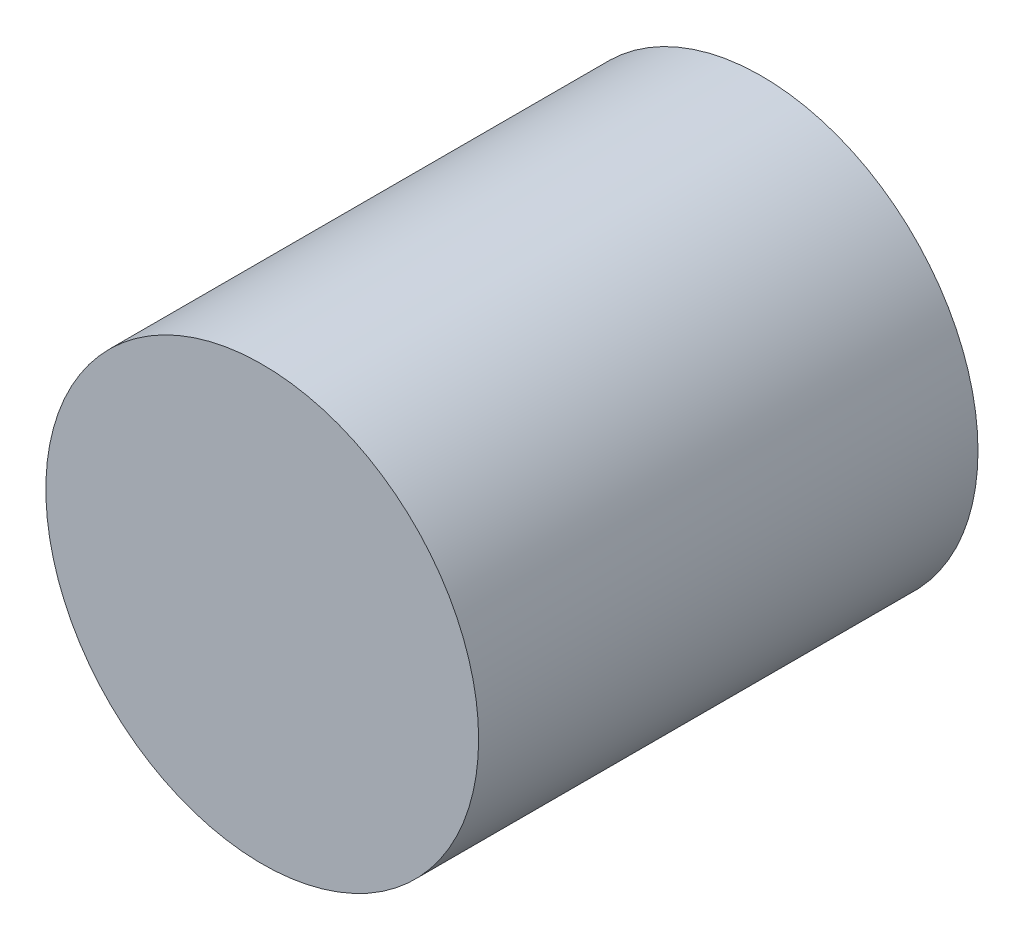
ISO-10303-21;
HEADER;
FILE_DESCRIPTION(('STEP AP214'),'2;1');
FILE_NAME('part.step','',(''),(''),'','','');
FILE_SCHEMA(('AUTOMOTIVE_DESIGN { 1 0 10303 214 1 1 1 1 }'));
ENDSEC;
DATA;
#1=APPLICATION_CONTEXT('core data for automotive mechanical design processes');
#2=APPLICATION_PROTOCOL_DEFINITION('international standard','automotive_design',2000,#1);
#3=PRODUCT_CONTEXT('',#1,'mechanical');
#4=PRODUCT('Part','Part','',(#3));
#5=PRODUCT_RELATED_PRODUCT_CATEGORY('part','',(#4));
#6=PRODUCT_DEFINITION_FORMATION('','',#4);
#7=PRODUCT_DEFINITION_CONTEXT('part definition',#1,'design');
#8=PRODUCT_DEFINITION('design','',#6,#7);
#9=PRODUCT_DEFINITION_SHAPE('','',#8);
#10=(LENGTH_UNIT() NAMED_UNIT(*) SI_UNIT(.MILLI.,.METRE.));
#11=(NAMED_UNIT(*) PLANE_ANGLE_UNIT() SI_UNIT($,.RADIAN.));
#12=(NAMED_UNIT(*) SI_UNIT($,.STERADIAN.) SOLID_ANGLE_UNIT());
#13=UNCERTAINTY_MEASURE_WITH_UNIT(LENGTH_MEASURE(1.E-05),#10,'distance_accuracy_value','');
#14=(GEOMETRIC_REPRESENTATION_CONTEXT(3) GLOBAL_UNCERTAINTY_ASSIGNED_CONTEXT((#13)) GLOBAL_UNIT_ASSIGNED_CONTEXT((#10,
#11,#12)) REPRESENTATION_CONTEXT('',''));
#15=CARTESIAN_POINT('',(0.,0.,0.));
#16=DIRECTION('',(0.,0.,1.));
#17=DIRECTION('',(1.,0.,0.));
#18=AXIS2_PLACEMENT_3D('',#15,#16,#17);
#19=CARTESIAN_POINT('',(0.,0.,9.));
#20=DIRECTION('',(0.,0.,-1.));
#21=DIRECTION('',(-1.,0.,0.));
#22=AXIS2_PLACEMENT_3D('',#19,#20,#21);
#23=CYLINDRICAL_SURFACE('',#22,3.899999947);
#24=CARTESIAN_POINT('',(0.,0.,9.));
#25=DIRECTION('',(0.,0.,1.));
#26=DIRECTION('',(1.,0.,0.));
#27=AXIS2_PLACEMENT_3D('',#24,#25,#26);
#28=CIRCLE('',#27,3.899999947);
#29=CARTESIAN_POINT('',(3.899999947,0.,9.));
#30=VERTEX_POINT('',#29);
#31=EDGE_CURVE('E10',#30,#30,#28,.T.);
#32=ORIENTED_EDGE('',*,*,#31,.F.);
#33=EDGE_LOOP('',(#32));
#34=FACE_BOUND('',#33,.T.);
#35=CARTESIAN_POINT('',(0.,0.,0.));
#36=DIRECTION('',(0.,0.,1.));
#37=DIRECTION('',(1.,0.,0.));
#38=AXIS2_PLACEMENT_3D('',#35,#36,#37);
#39=CIRCLE('',#38,3.899999947);
#40=CARTESIAN_POINT('',(3.899999947,0.,0.));
#41=VERTEX_POINT('',#40);
#42=EDGE_CURVE('E38',#41,#41,#39,.T.);
#43=ORIENTED_EDGE('',*,*,#42,.T.);
#44=EDGE_LOOP('',(#43));
#45=FACE_BOUND('',#44,.T.);
#46=ADVANCED_FACE('F35',(#34,#45),#23,.T.);
#47=CARTESIAN_POINT('',(0.,0.,9.));
#48=DIRECTION('',(0.,0.,1.));
#49=DIRECTION('',(1.,0.,0.));
#50=AXIS2_PLACEMENT_3D('',#47,#48,#49);
#51=PLANE('',#50);
#52=ORIENTED_EDGE('',*,*,#31,.T.);
#53=EDGE_LOOP('',(#52));
#54=FACE_BOUND('',#53,.T.);
#55=ADVANCED_FACE('F50',(#54),#51,.T.);
#56=CARTESIAN_POINT('',(0.,0.,0.));
#57=DIRECTION('',(0.,0.,1.));
#58=DIRECTION('',(1.,0.,0.));
#59=AXIS2_PLACEMENT_3D('',#56,#57,#58);
#60=PLANE('',#59);
#61=ORIENTED_EDGE('',*,*,#42,.F.);
#62=EDGE_LOOP('',(#61));
#63=FACE_BOUND('',#62,.T.);
#64=ADVANCED_FACE('F48',(#63),#60,.F.);
#65=CLOSED_SHELL('',(#46,#55,#64));
#66=MANIFOLD_SOLID_BREP('B2',#65);
#67=ADVANCED_BREP_SHAPE_REPRESENTATION('',(#18,#66),#14);
#68=SHAPE_DEFINITION_REPRESENTATION(#9,#67);
ENDSEC;
END-ISO-10303-21;
